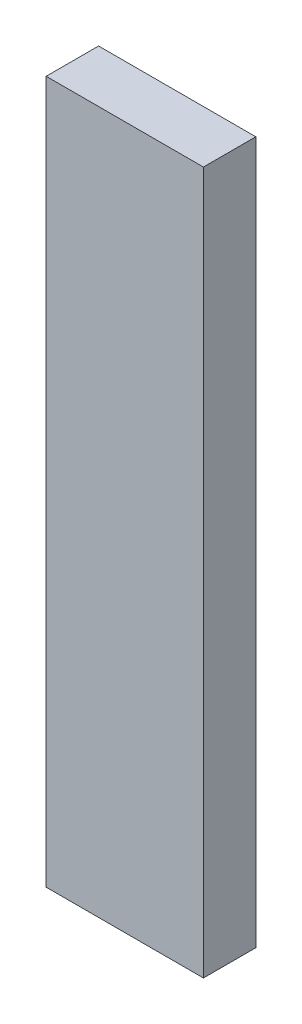
ISO-10303-21;
HEADER;
FILE_DESCRIPTION(('STEP AP214'),'2;1');
FILE_NAME('part.step','',(''),(''),'','','');
FILE_SCHEMA(('AUTOMOTIVE_DESIGN { 1 0 10303 214 1 1 1 1 }'));
ENDSEC;
DATA;
#1=APPLICATION_CONTEXT('core data for automotive mechanical design processes');
#2=APPLICATION_PROTOCOL_DEFINITION('international standard','automotive_design',2000,#1);
#3=PRODUCT_CONTEXT('',#1,'mechanical');
#4=PRODUCT('Part','Part','',(#3));
#5=PRODUCT_RELATED_PRODUCT_CATEGORY('part','',(#4));
#6=PRODUCT_DEFINITION_FORMATION('','',#4);
#7=PRODUCT_DEFINITION_CONTEXT('part definition',#1,'design');
#8=PRODUCT_DEFINITION('design','',#6,#7);
#9=PRODUCT_DEFINITION_SHAPE('','',#8);
#10=(LENGTH_UNIT() NAMED_UNIT(*) SI_UNIT(.MILLI.,.METRE.));
#11=(NAMED_UNIT(*) PLANE_ANGLE_UNIT() SI_UNIT($,.RADIAN.));
#12=(NAMED_UNIT(*) SI_UNIT($,.STERADIAN.) SOLID_ANGLE_UNIT());
#13=UNCERTAINTY_MEASURE_WITH_UNIT(LENGTH_MEASURE(1.E-05),#10,'distance_accuracy_value','');
#14=(GEOMETRIC_REPRESENTATION_CONTEXT(3) GLOBAL_UNCERTAINTY_ASSIGNED_CONTEXT((#13)) GLOBAL_UNIT_ASSIGNED_CONTEXT((#10,
#11,#12)) REPRESENTATION_CONTEXT('',''));
#15=CARTESIAN_POINT('',(0.,0.,0.));
#16=DIRECTION('',(0.,0.,1.));
#17=DIRECTION('',(1.,0.,0.));
#18=AXIS2_PLACEMENT_3D('',#15,#16,#17);
#19=CARTESIAN_POINT('',(0.,0.,5.));
#20=DIRECTION('',(0.,0.,1.));
#21=DIRECTION('',(1.,0.,0.));
#22=AXIS2_PLACEMENT_3D('',#19,#20,#21);
#23=PLANE('',#22);
#24=DIRECTION('',(-1.,0.,0.));
#25=VECTOR('',#24,1.);
#26=CARTESIAN_POINT('',(15.,0.,5.));
#27=LINE('',#26,#25);
#28=CARTESIAN_POINT('',(15.,0.,5.));
#29=VERTEX_POINT('',#28);
#30=CARTESIAN_POINT('',(0.,0.,5.));
#31=VERTEX_POINT('',#30);
#32=EDGE_CURVE('E64',#29,#31,#27,.T.);
#33=ORIENTED_EDGE('',*,*,#32,.F.);
#34=DIRECTION('',(0.,-1.,0.));
#35=VECTOR('',#34,1.);
#36=CARTESIAN_POINT('',(15.,67.,5.));
#37=LINE('',#36,#35);
#38=CARTESIAN_POINT('',(15.,67.,5.));
#39=VERTEX_POINT('',#38);
#40=EDGE_CURVE('E10',#39,#29,#37,.T.);
#41=ORIENTED_EDGE('',*,*,#40,.F.);
#42=DIRECTION('',(1.,0.,0.));
#43=VECTOR('',#42,1.);
#44=CARTESIAN_POINT('',(0.,67.,5.));
#45=LINE('',#44,#43);
#46=CARTESIAN_POINT('',(0.,67.,5.));
#47=VERTEX_POINT('',#46);
#48=EDGE_CURVE('E67',#47,#39,#45,.T.);
#49=ORIENTED_EDGE('',*,*,#48,.F.);
#50=DIRECTION('',(0.,1.,0.));
#51=VECTOR('',#50,1.);
#52=CARTESIAN_POINT('',(0.,0.,5.));
#53=LINE('',#52,#51);
#54=EDGE_CURVE('E61',#31,#47,#53,.T.);
#55=ORIENTED_EDGE('',*,*,#54,.F.);
#56=EDGE_LOOP('',(#33,#41,#49,#55));
#57=FACE_BOUND('',#56,.T.);
#58=ADVANCED_FACE('F16',(#57),#23,.T.);
#59=CARTESIAN_POINT('',(15.,0.,0.));
#60=DIRECTION('',(1.,0.,0.));
#61=DIRECTION('',(0.,1.,0.));
#62=AXIS2_PLACEMENT_3D('',#59,#60,#61);
#63=PLANE('',#62);
#64=DIRECTION('',(0.,-1.,0.));
#65=VECTOR('',#64,1.);
#66=CARTESIAN_POINT('',(15.,67.,0.));
#67=LINE('',#66,#65);
#68=CARTESIAN_POINT('',(15.,67.,0.));
#69=VERTEX_POINT('',#68);
#70=CARTESIAN_POINT('',(15.,0.,0.));
#71=VERTEX_POINT('',#70);
#72=EDGE_CURVE('E91',#69,#71,#67,.T.);
#73=ORIENTED_EDGE('',*,*,#72,.F.);
#74=DIRECTION('',(0.,0.,-1.));
#75=VECTOR('',#74,1.);
#76=CARTESIAN_POINT('',(15.,67.,5.));
#77=LINE('',#76,#75);
#78=EDGE_CURVE('E25',#39,#69,#77,.T.);
#79=ORIENTED_EDGE('',*,*,#78,.F.);
#80=ORIENTED_EDGE('',*,*,#40,.T.);
#81=DIRECTION('',(0.,0.,-1.));
#82=VECTOR('',#81,1.);
#83=CARTESIAN_POINT('',(15.,0.,5.));
#84=LINE('',#83,#82);
#85=EDGE_CURVE('E84',#29,#71,#84,.T.);
#86=ORIENTED_EDGE('',*,*,#85,.T.);
#87=EDGE_LOOP('',(#73,#79,#80,#86));
#88=FACE_BOUND('',#87,.T.);
#89=ADVANCED_FACE('F125',(#88),#63,.T.);
#90=CARTESIAN_POINT('',(15.,67.,0.));
#91=DIRECTION('',(0.,1.,0.));
#92=DIRECTION('',(1.,0.,0.));
#93=AXIS2_PLACEMENT_3D('',#90,#91,#92);
#94=PLANE('',#93);
#95=DIRECTION('',(1.,0.,0.));
#96=VECTOR('',#95,1.);
#97=CARTESIAN_POINT('',(0.,67.,0.));
#98=LINE('',#97,#96);
#99=CARTESIAN_POINT('',(0.,67.,0.));
#100=VERTEX_POINT('',#99);
#101=EDGE_CURVE('E108',#100,#69,#98,.T.);
#102=ORIENTED_EDGE('',*,*,#101,.F.);
#103=DIRECTION('',(0.,0.,-1.));
#104=VECTOR('',#103,1.);
#105=CARTESIAN_POINT('',(0.,67.,5.));
#106=LINE('',#105,#104);
#107=EDGE_CURVE('E71',#47,#100,#106,.T.);
#108=ORIENTED_EDGE('',*,*,#107,.F.);
#109=ORIENTED_EDGE('',*,*,#48,.T.);
#110=ORIENTED_EDGE('',*,*,#78,.T.);
#111=EDGE_LOOP('',(#102,#108,#109,#110));
#112=FACE_BOUND('',#111,.T.);
#113=ADVANCED_FACE('F106',(#112),#94,.T.);
#114=CARTESIAN_POINT('',(0.,67.,0.));
#115=DIRECTION('',(-1.,0.,0.));
#116=DIRECTION('',(0.,0.,1.));
#117=AXIS2_PLACEMENT_3D('',#114,#115,#116);
#118=PLANE('',#117);
#119=DIRECTION('',(0.,1.,0.));
#120=VECTOR('',#119,1.);
#121=CARTESIAN_POINT('',(0.,0.,0.));
#122=LINE('',#121,#120);
#123=CARTESIAN_POINT('',(0.,0.,0.));
#124=VERTEX_POINT('',#123);
#125=EDGE_CURVE('E77',#124,#100,#122,.T.);
#126=ORIENTED_EDGE('',*,*,#125,.F.);
#127=DIRECTION('',(0.,0.,-1.));
#128=VECTOR('',#127,1.);
#129=CARTESIAN_POINT('',(0.,0.,5.));
#130=LINE('',#129,#128);
#131=EDGE_CURVE('E72',#31,#124,#130,.T.);
#132=ORIENTED_EDGE('',*,*,#131,.F.);
#133=ORIENTED_EDGE('',*,*,#54,.T.);
#134=ORIENTED_EDGE('',*,*,#107,.T.);
#135=EDGE_LOOP('',(#126,#132,#133,#134));
#136=FACE_BOUND('',#135,.T.);
#137=ADVANCED_FACE('F75',(#136),#118,.T.);
#138=CARTESIAN_POINT('',(0.,0.,0.));
#139=DIRECTION('',(0.,-1.,0.));
#140=DIRECTION('',(0.,0.,-1.));
#141=AXIS2_PLACEMENT_3D('',#138,#139,#140);
#142=PLANE('',#141);
#143=DIRECTION('',(-1.,0.,0.));
#144=VECTOR('',#143,1.);
#145=CARTESIAN_POINT('',(15.,0.,0.));
#146=LINE('',#145,#144);
#147=EDGE_CURVE('E114',#71,#124,#146,.T.);
#148=ORIENTED_EDGE('',*,*,#147,.F.);
#149=ORIENTED_EDGE('',*,*,#85,.F.);
#150=ORIENTED_EDGE('',*,*,#32,.T.);
#151=ORIENTED_EDGE('',*,*,#131,.T.);
#152=EDGE_LOOP('',(#148,#149,#150,#151));
#153=FACE_BOUND('',#152,.T.);
#154=ADVANCED_FACE('F83',(#153),#142,.T.);
#155=CARTESIAN_POINT('',(0.,0.,0.));
#156=DIRECTION('',(0.,0.,1.));
#157=DIRECTION('',(1.,0.,0.));
#158=AXIS2_PLACEMENT_3D('',#155,#156,#157);
#159=PLANE('',#158);
#160=ORIENTED_EDGE('',*,*,#147,.T.);
#161=ORIENTED_EDGE('',*,*,#125,.T.);
#162=ORIENTED_EDGE('',*,*,#101,.T.);
#163=ORIENTED_EDGE('',*,*,#72,.T.);
#164=EDGE_LOOP('',(#160,#161,#162,#163));
#165=FACE_BOUND('',#164,.T.);
#166=ADVANCED_FACE('F113',(#165),#159,.F.);
#167=CLOSED_SHELL('',(#58,#89,#113,#137,#154,#166));
#168=MANIFOLD_SOLID_BREP('B1',#167);
#169=ADVANCED_BREP_SHAPE_REPRESENTATION('',(#18,#168),#14);
#170=SHAPE_DEFINITION_REPRESENTATION(#9,#169);
ENDSEC;
END-ISO-10303-21;
